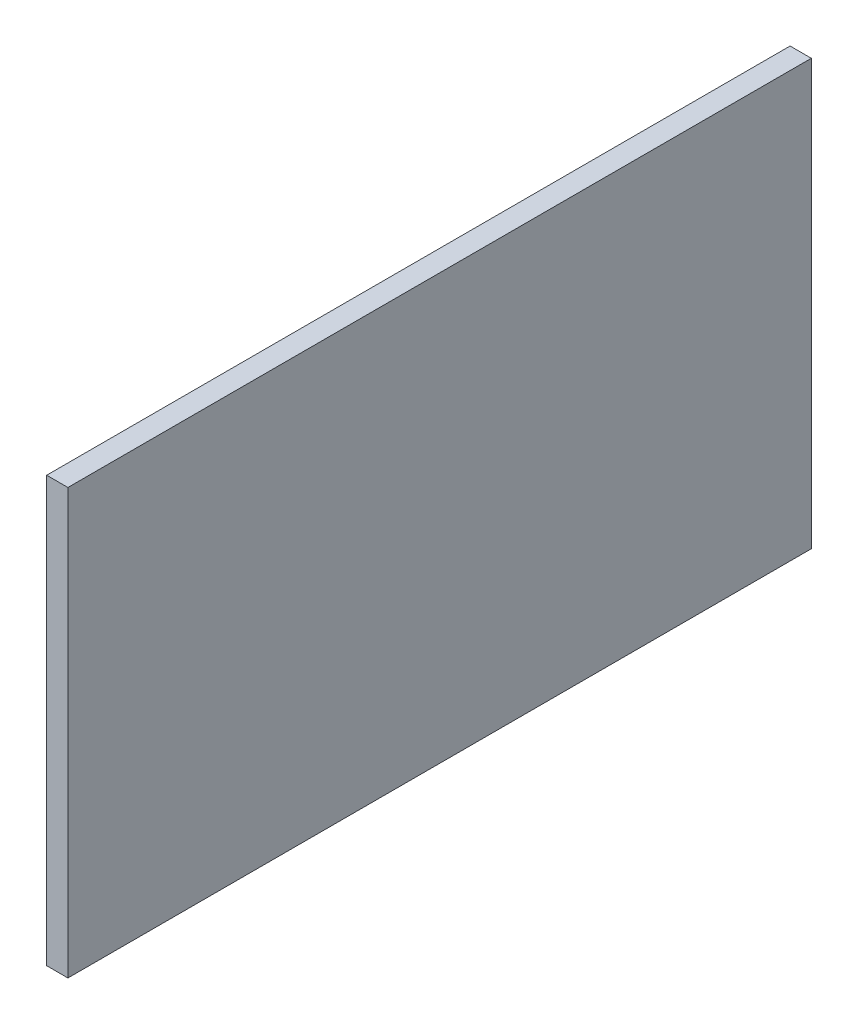
ISO-10303-21;
HEADER;
FILE_DESCRIPTION(('STEP AP214'),'2;1');
FILE_NAME('part.step','',(''),(''),'','','');
FILE_SCHEMA(('AUTOMOTIVE_DESIGN { 1 0 10303 214 1 1 1 1 }'));
ENDSEC;
DATA;
#1=APPLICATION_CONTEXT('core data for automotive mechanical design processes');
#2=APPLICATION_PROTOCOL_DEFINITION('international standard','automotive_design',2000,#1);
#3=PRODUCT_CONTEXT('',#1,'mechanical');
#4=PRODUCT('Part','Part','',(#3));
#5=PRODUCT_RELATED_PRODUCT_CATEGORY('part','',(#4));
#6=PRODUCT_DEFINITION_FORMATION('','',#4);
#7=PRODUCT_DEFINITION_CONTEXT('part definition',#1,'design');
#8=PRODUCT_DEFINITION('design','',#6,#7);
#9=PRODUCT_DEFINITION_SHAPE('','',#8);
#10=(LENGTH_UNIT() NAMED_UNIT(*) SI_UNIT(.MILLI.,.METRE.));
#11=(NAMED_UNIT(*) PLANE_ANGLE_UNIT() SI_UNIT($,.RADIAN.));
#12=(NAMED_UNIT(*) SI_UNIT($,.STERADIAN.) SOLID_ANGLE_UNIT());
#13=UNCERTAINTY_MEASURE_WITH_UNIT(LENGTH_MEASURE(1.E-05),#10,'distance_accuracy_value','');
#14=(GEOMETRIC_REPRESENTATION_CONTEXT(3) GLOBAL_UNCERTAINTY_ASSIGNED_CONTEXT((#13)) GLOBAL_UNIT_ASSIGNED_CONTEXT((#10,
#11,#12)) REPRESENTATION_CONTEXT('',''));
#15=CARTESIAN_POINT('',(0.,0.,0.));
#16=DIRECTION('',(0.,0.,1.));
#17=DIRECTION('',(1.,0.,0.));
#18=AXIS2_PLACEMENT_3D('',#15,#16,#17);
#19=CARTESIAN_POINT('',(0.,-100.,-175.));
#20=DIRECTION('',(1.,0.,0.));
#21=DIRECTION('',(0.,0.,-1.));
#22=AXIS2_PLACEMENT_3D('',#19,#20,#21);
#23=PLANE('',#22);
#24=CARTESIAN_POINT('',(0.,75.,-140.));
#25=DIRECTION('',(1.,0.,0.));
#26=DIRECTION('',(0.,0.,-1.));
#27=AXIS2_PLACEMENT_3D('',#24,#25,#26);
#28=CIRCLE('',#27,15.);
#29=CARTESIAN_POINT('',(0.,75.,-155.));
#30=VERTEX_POINT('',#29);
#31=EDGE_CURVE('E117',#30,#30,#28,.F.);
#32=ORIENTED_EDGE('',*,*,#31,.F.);
#33=EDGE_LOOP('',(#32));
#34=FACE_BOUND('',#33,.T.);
#35=DIRECTION('',(0.,1.,0.));
#36=VECTOR('',#35,1.);
#37=CARTESIAN_POINT('',(0.,100.,-175.));
#38=LINE('',#37,#36);
#39=CARTESIAN_POINT('',(0.,-100.,-175.));
#40=VERTEX_POINT('',#39);
#41=CARTESIAN_POINT('',(0.,100.,-175.));
#42=VERTEX_POINT('',#41);
#43=EDGE_CURVE('E107',#40,#42,#38,.T.);
#44=ORIENTED_EDGE('',*,*,#43,.F.);
#45=DIRECTION('',(0.,0.,-1.));
#46=VECTOR('',#45,1.);
#47=CARTESIAN_POINT('',(0.,-100.,175.));
#48=LINE('',#47,#46);
#49=CARTESIAN_POINT('',(0.,-100.,175.));
#50=VERTEX_POINT('',#49);
#51=EDGE_CURVE('E79',#50,#40,#48,.T.);
#52=ORIENTED_EDGE('',*,*,#51,.F.);
#53=DIRECTION('',(0.,-1.,0.));
#54=VECTOR('',#53,1.);
#55=CARTESIAN_POINT('',(0.,100.,175.));
#56=LINE('',#55,#54);
#57=CARTESIAN_POINT('',(0.,100.,175.));
#58=VERTEX_POINT('',#57);
#59=EDGE_CURVE('E73',#58,#50,#56,.T.);
#60=ORIENTED_EDGE('',*,*,#59,.F.);
#61=DIRECTION('',(0.,0.,1.));
#62=VECTOR('',#61,1.);
#63=CARTESIAN_POINT('',(0.,100.,175.));
#64=LINE('',#63,#62);
#65=EDGE_CURVE('E97',#42,#58,#64,.T.);
#66=ORIENTED_EDGE('',*,*,#65,.F.);
#67=EDGE_LOOP('',(#44,#52,#60,#66));
#68=FACE_BOUND('',#67,.T.);
#69=CARTESIAN_POINT('',(0.,75.,140.));
#70=DIRECTION('',(1.,0.,0.));
#71=DIRECTION('',(0.,0.,-1.));
#72=AXIS2_PLACEMENT_3D('',#69,#70,#71);
#73=CIRCLE('',#72,15.);
#74=CARTESIAN_POINT('',(0.,75.,125.));
#75=VERTEX_POINT('',#74);
#76=EDGE_CURVE('E126',#75,#75,#73,.F.);
#77=ORIENTED_EDGE('',*,*,#76,.F.);
#78=EDGE_LOOP('',(#77));
#79=FACE_BOUND('',#78,.T.);
#80=CARTESIAN_POINT('',(0.,-75.,-140.));
#81=DIRECTION('',(1.,0.,0.));
#82=DIRECTION('',(0.,0.,-1.));
#83=AXIS2_PLACEMENT_3D('',#80,#81,#82);
#84=CIRCLE('',#83,15.);
#85=CARTESIAN_POINT('',(0.,-75.,-155.));
#86=VERTEX_POINT('',#85);
#87=EDGE_CURVE('E129',#86,#86,#84,.F.);
#88=ORIENTED_EDGE('',*,*,#87,.F.);
#89=EDGE_LOOP('',(#88));
#90=FACE_BOUND('',#89,.T.);
#91=CARTESIAN_POINT('',(0.,-75.,140.));
#92=DIRECTION('',(1.,0.,0.));
#93=DIRECTION('',(0.,0.,-1.));
#94=AXIS2_PLACEMENT_3D('',#91,#92,#93);
#95=CIRCLE('',#94,15.);
#96=CARTESIAN_POINT('',(0.,-75.,125.));
#97=VERTEX_POINT('',#96);
#98=EDGE_CURVE('E138',#97,#97,#95,.F.);
#99=ORIENTED_EDGE('',*,*,#98,.F.);
#100=EDGE_LOOP('',(#99));
#101=FACE_BOUND('',#100,.T.);
#102=ADVANCED_FACE('F39',(#34,#68,#79,#90,#101),#23,.F.);
#103=CARTESIAN_POINT('',(10.,100.,-175.));
#104=DIRECTION('',(0.,0.,1.));
#105=DIRECTION('',(0.,-1.,0.));
#106=AXIS2_PLACEMENT_3D('',#103,#104,#105);
#107=PLANE('',#106);
#108=ORIENTED_EDGE('',*,*,#43,.T.);
#109=DIRECTION('',(-1.,0.,0.));
#110=VECTOR('',#109,1.);
#111=CARTESIAN_POINT('',(10.,100.,-175.));
#112=LINE('',#111,#110);
#113=CARTESIAN_POINT('',(10.,100.,-175.));
#114=VERTEX_POINT('',#113);
#115=EDGE_CURVE('E98',#114,#42,#112,.T.);
#116=ORIENTED_EDGE('',*,*,#115,.F.);
#117=DIRECTION('',(0.,1.,0.));
#118=VECTOR('',#117,1.);
#119=CARTESIAN_POINT('',(10.,100.,-175.));
#120=LINE('',#119,#118);
#121=CARTESIAN_POINT('',(10.,-100.,-175.));
#122=VERTEX_POINT('',#121);
#123=EDGE_CURVE('E92',#122,#114,#120,.T.);
#124=ORIENTED_EDGE('',*,*,#123,.F.);
#125=DIRECTION('',(-1.,0.,0.));
#126=VECTOR('',#125,1.);
#127=CARTESIAN_POINT('',(10.,-100.,-175.));
#128=LINE('',#127,#126);
#129=EDGE_CURVE('E103',#122,#40,#128,.T.);
#130=ORIENTED_EDGE('',*,*,#129,.T.);
#131=EDGE_LOOP('',(#108,#116,#124,#130));
#132=FACE_BOUND('',#131,.T.);
#133=ADVANCED_FACE('F158',(#132),#107,.F.);
#134=CARTESIAN_POINT('',(10.,100.,175.));
#135=DIRECTION('',(0.,-1.,0.));
#136=DIRECTION('',(0.,0.,-1.));
#137=AXIS2_PLACEMENT_3D('',#134,#135,#136);
#138=PLANE('',#137);
#139=ORIENTED_EDGE('',*,*,#65,.T.);
#140=DIRECTION('',(-1.,0.,0.));
#141=VECTOR('',#140,1.);
#142=CARTESIAN_POINT('',(10.,100.,175.));
#143=LINE('',#142,#141);
#144=CARTESIAN_POINT('',(10.,100.,175.));
#145=VERTEX_POINT('',#144);
#146=EDGE_CURVE('E95',#145,#58,#143,.T.);
#147=ORIENTED_EDGE('',*,*,#146,.F.);
#148=DIRECTION('',(0.,0.,1.));
#149=VECTOR('',#148,1.);
#150=CARTESIAN_POINT('',(10.,100.,175.));
#151=LINE('',#150,#149);
#152=EDGE_CURVE('E87',#114,#145,#151,.T.);
#153=ORIENTED_EDGE('',*,*,#152,.F.);
#154=ORIENTED_EDGE('',*,*,#115,.T.);
#155=EDGE_LOOP('',(#139,#147,#153,#154));
#156=FACE_BOUND('',#155,.T.);
#157=ADVANCED_FACE('F96',(#156),#138,.F.);
#158=CARTESIAN_POINT('',(10.,100.,175.));
#159=DIRECTION('',(0.,0.,-1.));
#160=DIRECTION('',(0.,1.,0.));
#161=AXIS2_PLACEMENT_3D('',#158,#159,#160);
#162=PLANE('',#161);
#163=ORIENTED_EDGE('',*,*,#59,.T.);
#164=DIRECTION('',(-1.,0.,0.));
#165=VECTOR('',#164,1.);
#166=CARTESIAN_POINT('',(10.,-100.,175.));
#167=LINE('',#166,#165);
#168=CARTESIAN_POINT('',(10.,-100.,175.));
#169=VERTEX_POINT('',#168);
#170=EDGE_CURVE('E99',#169,#50,#167,.T.);
#171=ORIENTED_EDGE('',*,*,#170,.F.);
#172=DIRECTION('',(0.,-1.,0.));
#173=VECTOR('',#172,1.);
#174=CARTESIAN_POINT('',(10.,100.,175.));
#175=LINE('',#174,#173);
#176=EDGE_CURVE('E90',#145,#169,#175,.T.);
#177=ORIENTED_EDGE('',*,*,#176,.F.);
#178=ORIENTED_EDGE('',*,*,#146,.T.);
#179=EDGE_LOOP('',(#163,#171,#177,#178));
#180=FACE_BOUND('',#179,.T.);
#181=ADVANCED_FACE('F101',(#180),#162,.F.);
#182=CARTESIAN_POINT('',(10.,-100.,175.));
#183=DIRECTION('',(0.,1.,0.));
#184=DIRECTION('',(0.,0.,1.));
#185=AXIS2_PLACEMENT_3D('',#182,#183,#184);
#186=PLANE('',#185);
#187=ORIENTED_EDGE('',*,*,#51,.T.);
#188=ORIENTED_EDGE('',*,*,#129,.F.);
#189=DIRECTION('',(0.,0.,-1.));
#190=VECTOR('',#189,1.);
#191=CARTESIAN_POINT('',(10.,-100.,175.));
#192=LINE('',#191,#190);
#193=EDGE_CURVE('E56',#169,#122,#192,.T.);
#194=ORIENTED_EDGE('',*,*,#193,.F.);
#195=ORIENTED_EDGE('',*,*,#170,.T.);
#196=EDGE_LOOP('',(#187,#188,#194,#195));
#197=FACE_BOUND('',#196,.T.);
#198=ADVANCED_FACE('F171',(#197),#186,.F.);
#199=CARTESIAN_POINT('',(10.,-100.,-175.));
#200=DIRECTION('',(1.,0.,0.));
#201=DIRECTION('',(0.,0.,-1.));
#202=AXIS2_PLACEMENT_3D('',#199,#200,#201);
#203=PLANE('',#202);
#204=ORIENTED_EDGE('',*,*,#123,.T.);
#205=ORIENTED_EDGE('',*,*,#152,.T.);
#206=ORIENTED_EDGE('',*,*,#176,.T.);
#207=ORIENTED_EDGE('',*,*,#193,.T.);
#208=EDGE_LOOP('',(#204,#205,#206,#207));
#209=FACE_BOUND('',#208,.T.);
#210=ADVANCED_FACE('F88',(#209),#203,.T.);
#211=CARTESIAN_POINT('',(-5.,75.,-140.));
#212=DIRECTION('',(1.,0.,0.));
#213=DIRECTION('',(0.,0.,-1.));
#214=AXIS2_PLACEMENT_3D('',#211,#212,#213);
#215=CYLINDRICAL_SURFACE('',#214,15.);
#216=CARTESIAN_POINT('',(-3.5,75.,-140.));
#217=DIRECTION('',(-1.,0.,0.));
#218=DIRECTION('',(0.,0.,1.));
#219=AXIS2_PLACEMENT_3D('',#216,#217,#218);
#220=CIRCLE('',#219,15.);
#221=CARTESIAN_POINT('',(-3.5,75.,-125.));
#222=VERTEX_POINT('',#221);
#223=EDGE_CURVE('E123',#222,#222,#220,.F.);
#224=ORIENTED_EDGE('',*,*,#223,.T.);
#225=EDGE_LOOP('',(#224));
#226=FACE_BOUND('',#225,.T.);
#227=ORIENTED_EDGE('',*,*,#31,.T.);
#228=EDGE_LOOP('',(#227));
#229=FACE_BOUND('',#228,.T.);
#230=ADVANCED_FACE('F215',(#226,#229),#215,.T.);
#231=CARTESIAN_POINT('',(-5.,75.,-140.));
#232=DIRECTION('',(-1.,0.,0.));
#233=DIRECTION('',(0.,0.,1.));
#234=AXIS2_PLACEMENT_3D('',#231,#232,#233);
#235=PLANE('',#234);
#236=CARTESIAN_POINT('',(-5.,75.,-140.));
#237=DIRECTION('',(-1.,0.,0.));
#238=DIRECTION('',(0.,0.,1.));
#239=AXIS2_PLACEMENT_3D('',#236,#237,#238);
#240=CIRCLE('',#239,13.5);
#241=CARTESIAN_POINT('',(-5.,75.,-126.5));
#242=VERTEX_POINT('',#241);
#243=EDGE_CURVE('E120',#242,#242,#240,.T.);
#244=ORIENTED_EDGE('',*,*,#243,.T.);
#245=EDGE_LOOP('',(#244));
#246=FACE_BOUND('',#245,.T.);
#247=ADVANCED_FACE('F182',(#246),#235,.T.);
#248=CARTESIAN_POINT('',(-3.5,75.,-140.));
#249=DIRECTION('',(-1.,0.,0.));
#250=DIRECTION('',(0.,0.,1.));
#251=AXIS2_PLACEMENT_3D('',#248,#249,#250);
#252=TOROIDAL_SURFACE('',#251,13.5,1.5);
#253=ORIENTED_EDGE('',*,*,#223,.F.);
#254=EDGE_LOOP('',(#253));
#255=FACE_BOUND('',#254,.T.);
#256=ORIENTED_EDGE('',*,*,#243,.F.);
#257=EDGE_LOOP('',(#256));
#258=FACE_BOUND('',#257,.T.);
#259=ADVANCED_FACE('F178',(#255,#258),#252,.T.);
#260=CARTESIAN_POINT('',(-5.,75.,140.));
#261=DIRECTION('',(1.,0.,0.));
#262=DIRECTION('',(0.,0.,-1.));
#263=AXIS2_PLACEMENT_3D('',#260,#261,#262);
#264=CYLINDRICAL_SURFACE('',#263,15.);
#265=CARTESIAN_POINT('',(-3.5,75.,140.));
#266=DIRECTION('',(-1.,0.,0.));
#267=DIRECTION('',(0.,0.,1.));
#268=AXIS2_PLACEMENT_3D('',#265,#266,#267);
#269=CIRCLE('',#268,15.);
#270=CARTESIAN_POINT('',(-3.5,75.,155.));
#271=VERTEX_POINT('',#270);
#272=EDGE_CURVE('E361',#271,#271,#269,.F.);
#273=ORIENTED_EDGE('',*,*,#272,.T.);
#274=EDGE_LOOP('',(#273));
#275=FACE_BOUND('',#274,.T.);
#276=ORIENTED_EDGE('',*,*,#76,.T.);
#277=EDGE_LOOP('',(#276));
#278=FACE_BOUND('',#277,.T.);
#279=ADVANCED_FACE('F181',(#275,#278),#264,.T.);
#280=CARTESIAN_POINT('',(-5.,75.,140.));
#281=DIRECTION('',(-1.,0.,0.));
#282=DIRECTION('',(0.,0.,1.));
#283=AXIS2_PLACEMENT_3D('',#280,#281,#282);
#284=PLANE('',#283);
#285=CARTESIAN_POINT('',(-5.,75.,140.));
#286=DIRECTION('',(-1.,0.,0.));
#287=DIRECTION('',(0.,0.,1.));
#288=AXIS2_PLACEMENT_3D('',#285,#286,#287);
#289=CIRCLE('',#288,13.5);
#290=CARTESIAN_POINT('',(-5.,75.,153.5));
#291=VERTEX_POINT('',#290);
#292=EDGE_CURVE('E110',#291,#291,#289,.T.);
#293=ORIENTED_EDGE('',*,*,#292,.T.);
#294=EDGE_LOOP('',(#293));
#295=FACE_BOUND('',#294,.T.);
#296=ADVANCED_FACE('F198',(#295),#284,.T.);
#297=CARTESIAN_POINT('',(-3.5,75.,140.));
#298=DIRECTION('',(-1.,0.,0.));
#299=DIRECTION('',(0.,0.,1.));
#300=AXIS2_PLACEMENT_3D('',#297,#298,#299);
#301=TOROIDAL_SURFACE('',#300,13.5,1.5);
#302=ORIENTED_EDGE('',*,*,#272,.F.);
#303=EDGE_LOOP('',(#302));
#304=FACE_BOUND('',#303,.T.);
#305=ORIENTED_EDGE('',*,*,#292,.F.);
#306=EDGE_LOOP('',(#305));
#307=FACE_BOUND('',#306,.T.);
#308=ADVANCED_FACE('F184',(#304,#307),#301,.T.);
#309=CARTESIAN_POINT('',(-3.5,-75.,-140.));
#310=DIRECTION('',(-1.,0.,0.));
#311=DIRECTION('',(0.,0.,1.));
#312=AXIS2_PLACEMENT_3D('',#309,#310,#311);
#313=TOROIDAL_SURFACE('',#312,13.5,1.5);
#314=CARTESIAN_POINT('',(-3.5,-75.,-140.));
#315=DIRECTION('',(-1.,0.,0.));
#316=DIRECTION('',(0.,0.,1.));
#317=AXIS2_PLACEMENT_3D('',#314,#315,#316);
#318=CIRCLE('',#317,15.);
#319=CARTESIAN_POINT('',(-3.5,-75.,-125.));
#320=VERTEX_POINT('',#319);
#321=EDGE_CURVE('E132',#320,#320,#318,.F.);
#322=ORIENTED_EDGE('',*,*,#321,.F.);
#323=EDGE_LOOP('',(#322));
#324=FACE_BOUND('',#323,.T.);
#325=CARTESIAN_POINT('',(-5.,-75.,-140.));
#326=DIRECTION('',(-1.,0.,0.));
#327=DIRECTION('',(0.,0.,1.));
#328=AXIS2_PLACEMENT_3D('',#325,#326,#327);
#329=CIRCLE('',#328,13.5);
#330=CARTESIAN_POINT('',(-5.,-75.,-126.5));
#331=VERTEX_POINT('',#330);
#332=EDGE_CURVE('E135',#331,#331,#329,.T.);
#333=ORIENTED_EDGE('',*,*,#332,.F.);
#334=EDGE_LOOP('',(#333));
#335=FACE_BOUND('',#334,.T.);
#336=ADVANCED_FACE('F191',(#324,#335),#313,.T.);
#337=CARTESIAN_POINT('',(-5.,-75.,-140.));
#338=DIRECTION('',(-1.,0.,0.));
#339=DIRECTION('',(0.,0.,1.));
#340=AXIS2_PLACEMENT_3D('',#337,#338,#339);
#341=PLANE('',#340);
#342=ORIENTED_EDGE('',*,*,#332,.T.);
#343=EDGE_LOOP('',(#342));
#344=FACE_BOUND('',#343,.T.);
#345=ADVANCED_FACE('F187',(#344),#341,.T.);
#346=CARTESIAN_POINT('',(-5.,-75.,-140.));
#347=DIRECTION('',(1.,0.,0.));
#348=DIRECTION('',(0.,0.,-1.));
#349=AXIS2_PLACEMENT_3D('',#346,#347,#348);
#350=CYLINDRICAL_SURFACE('',#349,15.);
#351=ORIENTED_EDGE('',*,*,#321,.T.);
#352=EDGE_LOOP('',(#351));
#353=FACE_BOUND('',#352,.T.);
#354=ORIENTED_EDGE('',*,*,#87,.T.);
#355=EDGE_LOOP('',(#354));
#356=FACE_BOUND('',#355,.T.);
#357=ADVANCED_FACE('F149',(#353,#356),#350,.T.);
#358=CARTESIAN_POINT('',(-3.5,-75.,140.));
#359=DIRECTION('',(-1.,0.,0.));
#360=DIRECTION('',(0.,0.,1.));
#361=AXIS2_PLACEMENT_3D('',#358,#359,#360);
#362=TOROIDAL_SURFACE('',#361,13.5,1.5);
#363=CARTESIAN_POINT('',(-3.5,-75.,140.));
#364=DIRECTION('',(-1.,0.,0.));
#365=DIRECTION('',(0.,0.,1.));
#366=AXIS2_PLACEMENT_3D('',#363,#364,#365);
#367=CIRCLE('',#366,15.);
#368=CARTESIAN_POINT('',(-3.5,-75.,155.));
#369=VERTEX_POINT('',#368);
#370=EDGE_CURVE('E48',#369,#369,#367,.F.);
#371=ORIENTED_EDGE('',*,*,#370,.F.);
#372=EDGE_LOOP('',(#371));
#373=FACE_BOUND('',#372,.T.);
#374=CARTESIAN_POINT('',(-5.,-75.,140.));
#375=DIRECTION('',(-1.,0.,0.));
#376=DIRECTION('',(0.,0.,1.));
#377=AXIS2_PLACEMENT_3D('',#374,#375,#376);
#378=CIRCLE('',#377,13.5);
#379=CARTESIAN_POINT('',(-5.,-75.,153.5));
#380=VERTEX_POINT('',#379);
#381=EDGE_CURVE('E11',#380,#380,#378,.T.);
#382=ORIENTED_EDGE('',*,*,#381,.F.);
#383=EDGE_LOOP('',(#382));
#384=FACE_BOUND('',#383,.T.);
#385=ADVANCED_FACE('F41',(#373,#384),#362,.T.);
#386=CARTESIAN_POINT('',(-5.,-75.,140.));
#387=DIRECTION('',(-1.,0.,0.));
#388=DIRECTION('',(0.,0.,1.));
#389=AXIS2_PLACEMENT_3D('',#386,#387,#388);
#390=PLANE('',#389);
#391=ORIENTED_EDGE('',*,*,#381,.T.);
#392=EDGE_LOOP('',(#391));
#393=FACE_BOUND('',#392,.T.);
#394=ADVANCED_FACE('F148',(#393),#390,.T.);
#395=CARTESIAN_POINT('',(-5.,-75.,140.));
#396=DIRECTION('',(1.,0.,0.));
#397=DIRECTION('',(0.,0.,-1.));
#398=AXIS2_PLACEMENT_3D('',#395,#396,#397);
#399=CYLINDRICAL_SURFACE('',#398,15.);
#400=ORIENTED_EDGE('',*,*,#370,.T.);
#401=EDGE_LOOP('',(#400));
#402=FACE_BOUND('',#401,.T.);
#403=ORIENTED_EDGE('',*,*,#98,.T.);
#404=EDGE_LOOP('',(#403));
#405=FACE_BOUND('',#404,.T.);
#406=ADVANCED_FACE('F143',(#402,#405),#399,.T.);
#407=CLOSED_SHELL('',(#102,#133,#157,#181,#198,#210,#230,#247,#259,#279,#296,#308,#336,#345,
#357,#385,#394,#406));
#408=MANIFOLD_SOLID_BREP('B2',#407);
#409=ADVANCED_BREP_SHAPE_REPRESENTATION('',(#18,#408),#14);
#410=SHAPE_DEFINITION_REPRESENTATION(#9,#409);
ENDSEC;
END-ISO-10303-21;
